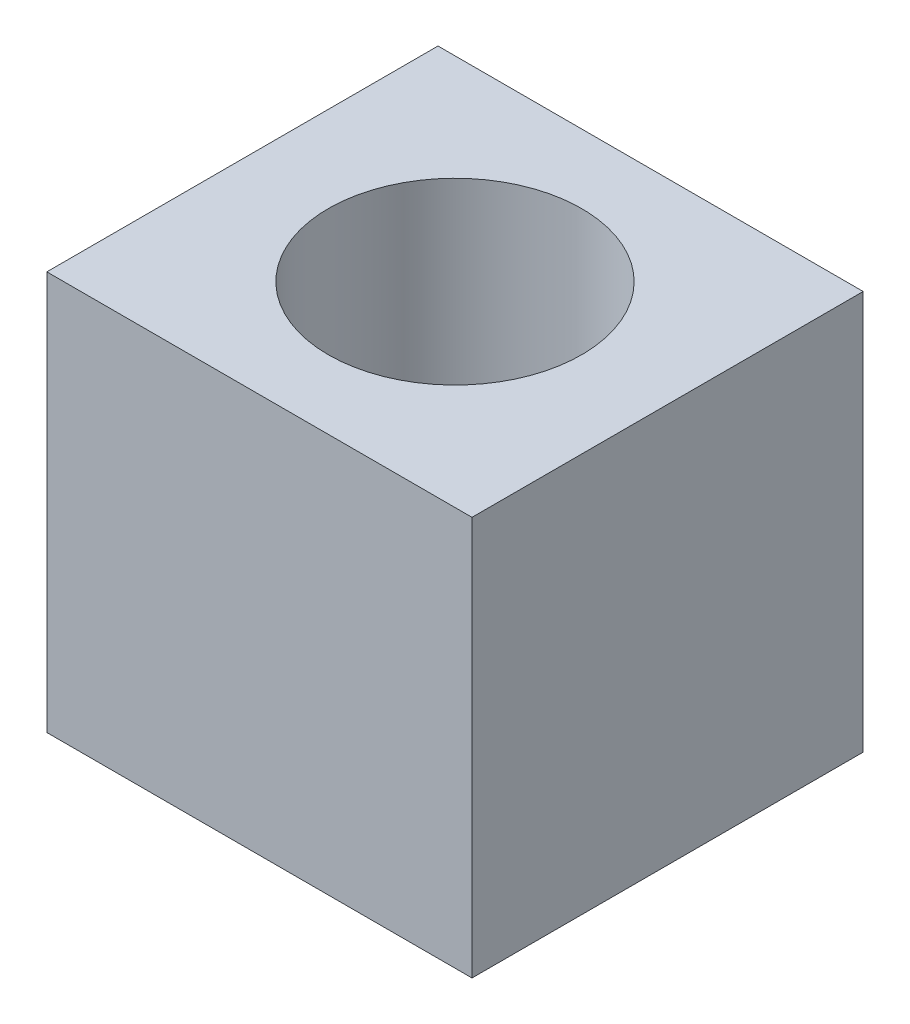
ISO-10303-21;
HEADER;
FILE_DESCRIPTION(('STEP AP214'),'2;1');
FILE_NAME('part.step','',(''),(''),'','','');
FILE_SCHEMA(('AUTOMOTIVE_DESIGN { 1 0 10303 214 1 1 1 1 }'));
ENDSEC;
DATA;
#1=APPLICATION_CONTEXT('core data for automotive mechanical design processes');
#2=APPLICATION_PROTOCOL_DEFINITION('international standard','automotive_design',2000,#1);
#3=PRODUCT_CONTEXT('',#1,'mechanical');
#4=PRODUCT('Part','Part','',(#3));
#5=PRODUCT_RELATED_PRODUCT_CATEGORY('part','',(#4));
#6=PRODUCT_DEFINITION_FORMATION('','',#4);
#7=PRODUCT_DEFINITION_CONTEXT('part definition',#1,'design');
#8=PRODUCT_DEFINITION('design','',#6,#7);
#9=PRODUCT_DEFINITION_SHAPE('','',#8);
#10=(LENGTH_UNIT() NAMED_UNIT(*) SI_UNIT(.MILLI.,.METRE.));
#11=(NAMED_UNIT(*) PLANE_ANGLE_UNIT() SI_UNIT($,.RADIAN.));
#12=(NAMED_UNIT(*) SI_UNIT($,.STERADIAN.) SOLID_ANGLE_UNIT());
#13=UNCERTAINTY_MEASURE_WITH_UNIT(LENGTH_MEASURE(1.E-05),#10,'distance_accuracy_value','');
#14=(GEOMETRIC_REPRESENTATION_CONTEXT(3) GLOBAL_UNCERTAINTY_ASSIGNED_CONTEXT((#13)) GLOBAL_UNIT_ASSIGNED_CONTEXT((#10,
#11,#12)) REPRESENTATION_CONTEXT('',''));
#15=CARTESIAN_POINT('',(0.,0.,0.));
#16=DIRECTION('',(0.,0.,1.));
#17=DIRECTION('',(1.,0.,0.));
#18=AXIS2_PLACEMENT_3D('',#15,#16,#17);
#19=CARTESIAN_POINT('',(0.,20.,0.));
#20=DIRECTION('',(0.,1.,0.));
#21=DIRECTION('',(0.,0.,1.));
#22=AXIS2_PLACEMENT_3D('',#19,#20,#21);
#23=PLANE('',#22);
#24=DIRECTION('',(0.,0.,-1.));
#25=VECTOR('',#24,1.);
#26=CARTESIAN_POINT('',(10.6571645630151,20.,-9.80459139797386));
#27=LINE('',#26,#25);
#28=CARTESIAN_POINT('',(10.6571645630151,20.,9.80459139797386));
#29=VERTEX_POINT('',#28);
#30=CARTESIAN_POINT('',(10.6571645630151,20.,-9.80459139797386));
#31=VERTEX_POINT('',#30);
#32=EDGE_CURVE('E85',#29,#31,#27,.T.);
#33=ORIENTED_EDGE('',*,*,#32,.T.);
#34=DIRECTION('',(-1.,0.,0.));
#35=VECTOR('',#34,1.);
#36=CARTESIAN_POINT('',(-10.6571645630151,20.,-9.80459139797386));
#37=LINE('',#36,#35);
#38=CARTESIAN_POINT('',(-10.6571645630151,20.,-9.80459139797386));
#39=VERTEX_POINT('',#38);
#40=EDGE_CURVE('E80',#31,#39,#37,.T.);
#41=ORIENTED_EDGE('',*,*,#40,.T.);
#42=DIRECTION('',(0.,0.,1.));
#43=VECTOR('',#42,1.);
#44=CARTESIAN_POINT('',(-10.6571645630151,20.,-9.80459139797386));
#45=LINE('',#44,#43);
#46=CARTESIAN_POINT('',(-10.6571645630151,20.,9.80459139797386));
#47=VERTEX_POINT('',#46);
#48=EDGE_CURVE('E83',#39,#47,#45,.T.);
#49=ORIENTED_EDGE('',*,*,#48,.T.);
#50=DIRECTION('',(1.,0.,0.));
#51=VECTOR('',#50,1.);
#52=CARTESIAN_POINT('',(-10.6571645630151,20.,9.80459139797386));
#53=LINE('',#52,#51);
#54=EDGE_CURVE('E50',#47,#29,#53,.T.);
#55=ORIENTED_EDGE('',*,*,#54,.T.);
#56=EDGE_LOOP('',(#33,#41,#49,#55));
#57=FACE_BOUND('',#56,.T.);
#58=CARTESIAN_POINT('',(0.,20.,0.));
#59=DIRECTION('',(0.,1.,0.));
#60=DIRECTION('',(0.,0.,1.));
#61=AXIS2_PLACEMENT_3D('',#58,#59,#60);
#62=CIRCLE('',#61,6.35);
#63=CARTESIAN_POINT('',(0.,20.,6.35));
#64=VERTEX_POINT('',#63);
#65=EDGE_CURVE('E100',#64,#64,#62,.T.);
#66=ORIENTED_EDGE('',*,*,#65,.F.);
#67=EDGE_LOOP('',(#66));
#68=FACE_BOUND('',#67,.T.);
#69=ADVANCED_FACE('F33',(#57,#68),#23,.T.);
#70=CARTESIAN_POINT('',(0.,0.,0.));
#71=DIRECTION('',(0.,1.,0.));
#72=DIRECTION('',(0.,0.,1.));
#73=AXIS2_PLACEMENT_3D('',#70,#71,#72);
#74=PLANE('',#73);
#75=DIRECTION('',(0.,0.,-1.));
#76=VECTOR('',#75,1.);
#77=CARTESIAN_POINT('',(10.6571645630151,0.,-9.80459139797386));
#78=LINE('',#77,#76);
#79=CARTESIAN_POINT('',(10.6571645630151,0.,9.80459139797386));
#80=VERTEX_POINT('',#79);
#81=CARTESIAN_POINT('',(10.6571645630151,0.,-9.80459139797386));
#82=VERTEX_POINT('',#81);
#83=EDGE_CURVE('E97',#80,#82,#78,.T.);
#84=ORIENTED_EDGE('',*,*,#83,.F.);
#85=DIRECTION('',(1.,0.,0.));
#86=VECTOR('',#85,1.);
#87=CARTESIAN_POINT('',(-10.6571645630151,0.,9.80459139797386));
#88=LINE('',#87,#86);
#89=CARTESIAN_POINT('',(-10.6571645630151,0.,9.80459139797386));
#90=VERTEX_POINT('',#89);
#91=EDGE_CURVE('E73',#90,#80,#88,.T.);
#92=ORIENTED_EDGE('',*,*,#91,.F.);
#93=DIRECTION('',(0.,0.,1.));
#94=VECTOR('',#93,1.);
#95=CARTESIAN_POINT('',(-10.6571645630151,0.,-9.80459139797386));
#96=LINE('',#95,#94);
#97=CARTESIAN_POINT('',(-10.6571645630151,0.,-9.80459139797386));
#98=VERTEX_POINT('',#97);
#99=EDGE_CURVE('E67',#98,#90,#96,.T.);
#100=ORIENTED_EDGE('',*,*,#99,.F.);
#101=DIRECTION('',(-1.,0.,0.));
#102=VECTOR('',#101,1.);
#103=CARTESIAN_POINT('',(-10.6571645630151,0.,-9.80459139797386));
#104=LINE('',#103,#102);
#105=EDGE_CURVE('E89',#82,#98,#104,.T.);
#106=ORIENTED_EDGE('',*,*,#105,.F.);
#107=EDGE_LOOP('',(#84,#92,#100,#106));
#108=FACE_BOUND('',#107,.T.);
#109=CARTESIAN_POINT('',(0.,0.,0.));
#110=DIRECTION('',(0.,1.,0.));
#111=DIRECTION('',(0.,0.,1.));
#112=AXIS2_PLACEMENT_3D('',#109,#110,#111);
#113=CIRCLE('',#112,6.35);
#114=CARTESIAN_POINT('',(0.,0.,6.35));
#115=VERTEX_POINT('',#114);
#116=EDGE_CURVE('E112',#115,#115,#113,.T.);
#117=ORIENTED_EDGE('',*,*,#116,.T.);
#118=EDGE_LOOP('',(#117));
#119=FACE_BOUND('',#118,.T.);
#120=ADVANCED_FACE('F108',(#108,#119),#74,.F.);
#121=CARTESIAN_POINT('',(10.6571645630151,20.,-9.80459139797386));
#122=DIRECTION('',(-1.,0.,0.));
#123=DIRECTION('',(0.,0.,1.));
#124=AXIS2_PLACEMENT_3D('',#121,#122,#123);
#125=PLANE('',#124);
#126=ORIENTED_EDGE('',*,*,#83,.T.);
#127=DIRECTION('',(0.,-1.,0.));
#128=VECTOR('',#127,1.);
#129=CARTESIAN_POINT('',(10.6571645630151,20.,-9.80459139797386));
#130=LINE('',#129,#128);
#131=EDGE_CURVE('E11',#31,#82,#130,.T.);
#132=ORIENTED_EDGE('',*,*,#131,.F.);
#133=ORIENTED_EDGE('',*,*,#32,.F.);
#134=DIRECTION('',(0.,-1.,0.));
#135=VECTOR('',#134,1.);
#136=CARTESIAN_POINT('',(10.6571645630151,20.,9.80459139797386));
#137=LINE('',#136,#135);
#138=EDGE_CURVE('E93',#29,#80,#137,.T.);
#139=ORIENTED_EDGE('',*,*,#138,.T.);
#140=EDGE_LOOP('',(#126,#132,#133,#139));
#141=FACE_BOUND('',#140,.T.);
#142=ADVANCED_FACE('F35',(#141),#125,.F.);
#143=CARTESIAN_POINT('',(-10.6571645630151,20.,-9.80459139797386));
#144=DIRECTION('',(0.,0.,1.));
#145=DIRECTION('',(1.,0.,0.));
#146=AXIS2_PLACEMENT_3D('',#143,#144,#145);
#147=PLANE('',#146);
#148=ORIENTED_EDGE('',*,*,#105,.T.);
#149=DIRECTION('',(0.,-1.,0.));
#150=VECTOR('',#149,1.);
#151=CARTESIAN_POINT('',(-10.6571645630151,20.,-9.80459139797386));
#152=LINE('',#151,#150);
#153=EDGE_CURVE('E42',#39,#98,#152,.T.);
#154=ORIENTED_EDGE('',*,*,#153,.F.);
#155=ORIENTED_EDGE('',*,*,#40,.F.);
#156=ORIENTED_EDGE('',*,*,#131,.T.);
#157=EDGE_LOOP('',(#148,#154,#155,#156));
#158=FACE_BOUND('',#157,.T.);
#159=ADVANCED_FACE('F88',(#158),#147,.F.);
#160=CARTESIAN_POINT('',(-10.6571645630151,20.,-9.80459139797386));
#161=DIRECTION('',(1.,0.,0.));
#162=DIRECTION('',(0.,0.,-1.));
#163=AXIS2_PLACEMENT_3D('',#160,#161,#162);
#164=PLANE('',#163);
#165=ORIENTED_EDGE('',*,*,#99,.T.);
#166=DIRECTION('',(0.,-1.,0.));
#167=VECTOR('',#166,1.);
#168=CARTESIAN_POINT('',(-10.6571645630151,20.,9.80459139797386));
#169=LINE('',#168,#167);
#170=EDGE_CURVE('E90',#47,#90,#169,.T.);
#171=ORIENTED_EDGE('',*,*,#170,.F.);
#172=ORIENTED_EDGE('',*,*,#48,.F.);
#173=ORIENTED_EDGE('',*,*,#153,.T.);
#174=EDGE_LOOP('',(#165,#171,#172,#173));
#175=FACE_BOUND('',#174,.T.);
#176=ADVANCED_FACE('F91',(#175),#164,.F.);
#177=CARTESIAN_POINT('',(-10.6571645630151,20.,9.80459139797386));
#178=DIRECTION('',(0.,0.,-1.));
#179=DIRECTION('',(-1.,0.,0.));
#180=AXIS2_PLACEMENT_3D('',#177,#178,#179);
#181=PLANE('',#180);
#182=ORIENTED_EDGE('',*,*,#91,.T.);
#183=ORIENTED_EDGE('',*,*,#138,.F.);
#184=ORIENTED_EDGE('',*,*,#54,.F.);
#185=ORIENTED_EDGE('',*,*,#170,.T.);
#186=EDGE_LOOP('',(#182,#183,#184,#185));
#187=FACE_BOUND('',#186,.T.);
#188=ADVANCED_FACE('F105',(#187),#181,.F.);
#189=CARTESIAN_POINT('',(0.,20.,0.));
#190=DIRECTION('',(0.,-1.,0.));
#191=DIRECTION('',(0.,0.,-1.));
#192=AXIS2_PLACEMENT_3D('',#189,#190,#191);
#193=CYLINDRICAL_SURFACE('',#192,6.35);
#194=ORIENTED_EDGE('',*,*,#65,.T.);
#195=EDGE_LOOP('',(#194));
#196=FACE_BOUND('',#195,.T.);
#197=ORIENTED_EDGE('',*,*,#116,.F.);
#198=EDGE_LOOP('',(#197));
#199=FACE_BOUND('',#198,.T.);
#200=ADVANCED_FACE('F118',(#196,#199),#193,.F.);
#201=CLOSED_SHELL('',(#69,#120,#142,#159,#176,#188,#200));
#202=MANIFOLD_SOLID_BREP('B2',#201);
#203=ADVANCED_BREP_SHAPE_REPRESENTATION('',(#18,#202),#14);
#204=SHAPE_DEFINITION_REPRESENTATION(#9,#203);
ENDSEC;
END-ISO-10303-21;
